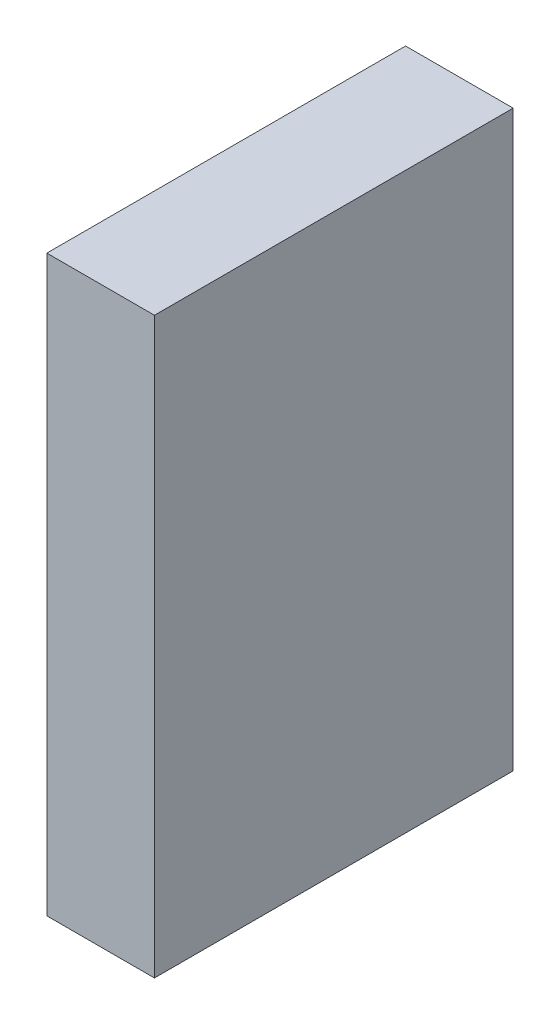
ISO-10303-21;
HEADER;
FILE_DESCRIPTION(('STEP AP214'),'2;1');
FILE_NAME('part.step','',(''),(''),'','','');
FILE_SCHEMA(('AUTOMOTIVE_DESIGN { 1 0 10303 214 1 1 1 1 }'));
ENDSEC;
DATA;
#1=APPLICATION_CONTEXT('core data for automotive mechanical design processes');
#2=APPLICATION_PROTOCOL_DEFINITION('international standard','automotive_design',2000,#1);
#3=PRODUCT_CONTEXT('',#1,'mechanical');
#4=PRODUCT('Part','Part','',(#3));
#5=PRODUCT_RELATED_PRODUCT_CATEGORY('part','',(#4));
#6=PRODUCT_DEFINITION_FORMATION('','',#4);
#7=PRODUCT_DEFINITION_CONTEXT('part definition',#1,'design');
#8=PRODUCT_DEFINITION('design','',#6,#7);
#9=PRODUCT_DEFINITION_SHAPE('','',#8);
#10=(LENGTH_UNIT() NAMED_UNIT(*) SI_UNIT(.MILLI.,.METRE.));
#11=(NAMED_UNIT(*) PLANE_ANGLE_UNIT() SI_UNIT($,.RADIAN.));
#12=(NAMED_UNIT(*) SI_UNIT($,.STERADIAN.) SOLID_ANGLE_UNIT());
#13=UNCERTAINTY_MEASURE_WITH_UNIT(LENGTH_MEASURE(1.E-05),#10,'distance_accuracy_value','');
#14=(GEOMETRIC_REPRESENTATION_CONTEXT(3) GLOBAL_UNCERTAINTY_ASSIGNED_CONTEXT((#13)) GLOBAL_UNIT_ASSIGNED_CONTEXT((#10,
#11,#12)) REPRESENTATION_CONTEXT('',''));
#15=CARTESIAN_POINT('',(0.,0.,0.));
#16=DIRECTION('',(0.,0.,1.));
#17=DIRECTION('',(1.,0.,0.));
#18=AXIS2_PLACEMENT_3D('',#15,#16,#17);
#19=CARTESIAN_POINT('',(-0.07500112,0.3999992,0.));
#20=DIRECTION('',(1.,0.,0.));
#21=DIRECTION('',(0.,0.,-1.));
#22=AXIS2_PLACEMENT_3D('',#19,#20,#21);
#23=PLANE('',#22);
#24=DIRECTION('',(0.,0.,1.));
#25=VECTOR('',#24,1.);
#26=CARTESIAN_POINT('',(-0.07500112,-0.3999992,0.));
#27=LINE('',#26,#25);
#28=CARTESIAN_POINT('',(-0.07500112,-0.3999992,0.));
#29=VERTEX_POINT('',#28);
#30=CARTESIAN_POINT('',(-0.07500112,-0.3999992,0.499999));
#31=VERTEX_POINT('',#30);
#32=EDGE_CURVE('E20',#29,#31,#27,.T.);
#33=ORIENTED_EDGE('',*,*,#32,.T.);
#34=DIRECTION('',(0.,1.,0.));
#35=VECTOR('',#34,1.);
#36=CARTESIAN_POINT('',(-0.07500112,-0.3999992,0.499999));
#37=LINE('',#36,#35);
#38=CARTESIAN_POINT('',(-0.07500112,0.3999992,0.499999));
#39=VERTEX_POINT('',#38);
#40=EDGE_CURVE('E55',#31,#39,#37,.T.);
#41=ORIENTED_EDGE('',*,*,#40,.T.);
#42=DIRECTION('',(0.,0.,-1.));
#43=VECTOR('',#42,1.);
#44=CARTESIAN_POINT('',(-0.07500112,0.3999992,0.));
#45=LINE('',#44,#43);
#46=CARTESIAN_POINT('',(-0.07500112,0.3999992,0.));
#47=VERTEX_POINT('',#46);
#48=EDGE_CURVE('E74',#39,#47,#45,.T.);
#49=ORIENTED_EDGE('',*,*,#48,.T.);
#50=DIRECTION('',(0.,1.,0.));
#51=VECTOR('',#50,1.);
#52=CARTESIAN_POINT('',(-0.07500112,-0.3999992,0.));
#53=LINE('',#52,#51);
#54=EDGE_CURVE('E66',#29,#47,#53,.T.);
#55=ORIENTED_EDGE('',*,*,#54,.F.);
#56=EDGE_LOOP('',(#33,#41,#49,#55));
#57=FACE_BOUND('',#56,.T.);
#58=ADVANCED_FACE('F17',(#57),#23,.F.);
#59=CARTESIAN_POINT('',(-0.07500112,-0.3999992,0.));
#60=DIRECTION('',(0.,1.,0.));
#61=DIRECTION('',(0.,0.,1.));
#62=AXIS2_PLACEMENT_3D('',#59,#60,#61);
#63=PLANE('',#62);
#64=DIRECTION('',(0.,0.,1.));
#65=VECTOR('',#64,1.);
#66=CARTESIAN_POINT('',(0.07500112,-0.3999992,0.));
#67=LINE('',#66,#65);
#68=CARTESIAN_POINT('',(0.07500112,-0.3999992,0.));
#69=VERTEX_POINT('',#68);
#70=CARTESIAN_POINT('',(0.07500112,-0.3999992,0.499999));
#71=VERTEX_POINT('',#70);
#72=EDGE_CURVE('E72',#69,#71,#67,.T.);
#73=ORIENTED_EDGE('',*,*,#72,.T.);
#74=DIRECTION('',(-1.,0.,0.));
#75=VECTOR('',#74,1.);
#76=CARTESIAN_POINT('',(-0.07500112,-0.3999992,0.499999));
#77=LINE('',#76,#75);
#78=EDGE_CURVE('E62',#71,#31,#77,.T.);
#79=ORIENTED_EDGE('',*,*,#78,.T.);
#80=ORIENTED_EDGE('',*,*,#32,.F.);
#81=DIRECTION('',(-1.,0.,0.));
#82=VECTOR('',#81,1.);
#83=CARTESIAN_POINT('',(-0.07500112,-0.3999992,0.));
#84=LINE('',#83,#82);
#85=EDGE_CURVE('E80',#69,#29,#84,.T.);
#86=ORIENTED_EDGE('',*,*,#85,.F.);
#87=EDGE_LOOP('',(#73,#79,#80,#86));
#88=FACE_BOUND('',#87,.T.);
#89=ADVANCED_FACE('F71',(#88),#63,.F.);
#90=CARTESIAN_POINT('',(-0.07500112,-0.3999992,0.499999));
#91=DIRECTION('',(0.,0.,-1.));
#92=DIRECTION('',(-1.,0.,0.));
#93=AXIS2_PLACEMENT_3D('',#90,#91,#92);
#94=PLANE('',#93);
#95=DIRECTION('',(0.,1.,0.));
#96=VECTOR('',#95,1.);
#97=CARTESIAN_POINT('',(0.07500112,-0.3999992,0.499999));
#98=LINE('',#97,#96);
#99=CARTESIAN_POINT('',(0.07500112,0.3999992,0.499999));
#100=VERTEX_POINT('',#99);
#101=EDGE_CURVE('E83',#71,#100,#98,.T.);
#102=ORIENTED_EDGE('',*,*,#101,.T.);
#103=DIRECTION('',(1.,0.,0.));
#104=VECTOR('',#103,1.);
#105=CARTESIAN_POINT('',(0.07500112,0.3999992,0.499999));
#106=LINE('',#105,#104);
#107=EDGE_CURVE('E64',#100,#39,#106,.F.);
#108=ORIENTED_EDGE('',*,*,#107,.T.);
#109=ORIENTED_EDGE('',*,*,#40,.F.);
#110=ORIENTED_EDGE('',*,*,#78,.F.);
#111=EDGE_LOOP('',(#102,#108,#109,#110));
#112=FACE_BOUND('',#111,.T.);
#113=ADVANCED_FACE('F60',(#112),#94,.F.);
#114=CARTESIAN_POINT('',(0.07500112,0.3999992,0.));
#115=DIRECTION('',(0.,-1.,0.));
#116=DIRECTION('',(0.,0.,-1.));
#117=AXIS2_PLACEMENT_3D('',#114,#115,#116);
#118=PLANE('',#117);
#119=ORIENTED_EDGE('',*,*,#48,.F.);
#120=ORIENTED_EDGE('',*,*,#107,.F.);
#121=DIRECTION('',(0.,0.,1.));
#122=VECTOR('',#121,1.);
#123=CARTESIAN_POINT('',(0.07500112,0.3999992,0.));
#124=LINE('',#123,#122);
#125=CARTESIAN_POINT('',(0.07500112,0.3999992,0.));
#126=VERTEX_POINT('',#125);
#127=EDGE_CURVE('E26',#100,#126,#124,.F.);
#128=ORIENTED_EDGE('',*,*,#127,.T.);
#129=DIRECTION('',(-1.,0.,0.));
#130=VECTOR('',#129,1.);
#131=CARTESIAN_POINT('',(-0.07500112,0.3999992,0.));
#132=LINE('',#131,#130);
#133=EDGE_CURVE('E34',#47,#126,#132,.F.);
#134=ORIENTED_EDGE('',*,*,#133,.F.);
#135=EDGE_LOOP('',(#119,#120,#128,#134));
#136=FACE_BOUND('',#135,.T.);
#137=ADVANCED_FACE('F88',(#136),#118,.F.);
#138=CARTESIAN_POINT('',(-0.07500112,-0.3999992,0.));
#139=DIRECTION('',(0.,0.,-1.));
#140=DIRECTION('',(-1.,0.,0.));
#141=AXIS2_PLACEMENT_3D('',#138,#139,#140);
#142=PLANE('',#141);
#143=DIRECTION('',(0.,1.,0.));
#144=VECTOR('',#143,1.);
#145=CARTESIAN_POINT('',(0.07500112,-0.3999992,0.));
#146=LINE('',#145,#144);
#147=EDGE_CURVE('E11',#126,#69,#146,.F.);
#148=ORIENTED_EDGE('',*,*,#147,.T.);
#149=ORIENTED_EDGE('',*,*,#85,.T.);
#150=ORIENTED_EDGE('',*,*,#54,.T.);
#151=ORIENTED_EDGE('',*,*,#133,.T.);
#152=EDGE_LOOP('',(#148,#149,#150,#151));
#153=FACE_BOUND('',#152,.T.);
#154=ADVANCED_FACE('F91',(#153),#142,.T.);
#155=CARTESIAN_POINT('',(0.07500112,-0.3999992,0.));
#156=DIRECTION('',(-1.,0.,0.));
#157=DIRECTION('',(0.,0.,1.));
#158=AXIS2_PLACEMENT_3D('',#155,#156,#157);
#159=PLANE('',#158);
#160=ORIENTED_EDGE('',*,*,#127,.F.);
#161=ORIENTED_EDGE('',*,*,#101,.F.);
#162=ORIENTED_EDGE('',*,*,#72,.F.);
#163=ORIENTED_EDGE('',*,*,#147,.F.);
#164=EDGE_LOOP('',(#160,#161,#162,#163));
#165=FACE_BOUND('',#164,.T.);
#166=ADVANCED_FACE('F90',(#165),#159,.F.);
#167=CLOSED_SHELL('',(#58,#89,#113,#137,#154,#166));
#168=MANIFOLD_SOLID_BREP('B1',#167);
#169=ADVANCED_BREP_SHAPE_REPRESENTATION('',(#18,#168),#14);
#170=SHAPE_DEFINITION_REPRESENTATION(#9,#169);
ENDSEC;
END-ISO-10303-21;
